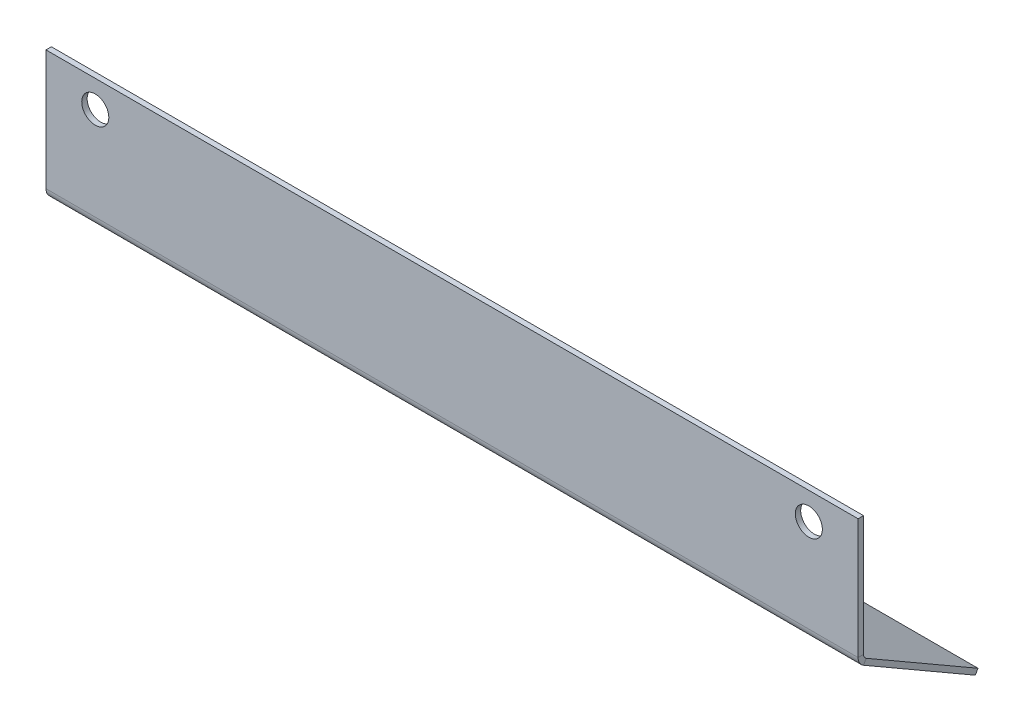
ISO-10303-21;
HEADER;
FILE_DESCRIPTION(('STEP AP214'),'2;1');
FILE_NAME('part.step','',(''),(''),'','','');
FILE_SCHEMA(('AUTOMOTIVE_DESIGN { 1 0 10303 214 1 1 1 1 }'));
ENDSEC;
DATA;
#1=APPLICATION_CONTEXT('core data for automotive mechanical design processes');
#2=APPLICATION_PROTOCOL_DEFINITION('international standard','automotive_design',2000,#1);
#3=PRODUCT_CONTEXT('',#1,'mechanical');
#4=PRODUCT('Part','Part','',(#3));
#5=PRODUCT_RELATED_PRODUCT_CATEGORY('part','',(#4));
#6=PRODUCT_DEFINITION_FORMATION('','',#4);
#7=PRODUCT_DEFINITION_CONTEXT('part definition',#1,'design');
#8=PRODUCT_DEFINITION('design','',#6,#7);
#9=PRODUCT_DEFINITION_SHAPE('','',#8);
#10=(LENGTH_UNIT() NAMED_UNIT(*) SI_UNIT(.MILLI.,.METRE.));
#11=(NAMED_UNIT(*) PLANE_ANGLE_UNIT() SI_UNIT($,.RADIAN.));
#12=(NAMED_UNIT(*) SI_UNIT($,.STERADIAN.) SOLID_ANGLE_UNIT());
#13=UNCERTAINTY_MEASURE_WITH_UNIT(LENGTH_MEASURE(1.E-05),#10,'distance_accuracy_value','');
#14=(GEOMETRIC_REPRESENTATION_CONTEXT(3) GLOBAL_UNCERTAINTY_ASSIGNED_CONTEXT((#13)) GLOBAL_UNIT_ASSIGNED_CONTEXT((#10,
#11,#12)) REPRESENTATION_CONTEXT('',''));
#15=CARTESIAN_POINT('',(0.,0.,0.));
#16=DIRECTION('',(0.,0.,1.));
#17=DIRECTION('',(1.,0.,0.));
#18=AXIS2_PLACEMENT_3D('',#15,#16,#17);
#19=CARTESIAN_POINT('',(-100.,29.2292264016467,-1.));
#20=DIRECTION('',(-1.,0.,0.));
#21=DIRECTION('',(0.,-1.,0.));
#22=AXIS2_PLACEMENT_3D('',#19,#20,#21);
#23=PLANE('',#22);
#24=DIRECTION('',(0.,-1.,0.));
#25=VECTOR('',#24,1.);
#26=CARTESIAN_POINT('',(-100.,29.2292264016467,-1.));
#27=LINE('',#26,#25);
#28=CARTESIAN_POINT('',(-100.,29.2292264016467,-1.));
#29=VERTEX_POINT('',#28);
#30=CARTESIAN_POINT('',(-100.,7.02602081011303,-1.));
#31=VERTEX_POINT('',#30);
#32=EDGE_CURVE('E125',#29,#31,#27,.T.);
#33=ORIENTED_EDGE('',*,*,#32,.T.);
#34=DIRECTION('',(0.,0.,1.));
#35=VECTOR('',#34,1.);
#36=CARTESIAN_POINT('',(-100.,7.02602081011303,-1.));
#37=LINE('',#36,#35);
#38=CARTESIAN_POINT('',(-100.,7.02602081011303,0.));
#39=VERTEX_POINT('',#38);
#40=EDGE_CURVE('E116',#31,#39,#37,.T.);
#41=ORIENTED_EDGE('',*,*,#40,.T.);
#42=DIRECTION('',(0.,-1.,0.));
#43=VECTOR('',#42,1.);
#44=CARTESIAN_POINT('',(-100.,29.2292264016467,0.));
#45=LINE('',#44,#43);
#46=CARTESIAN_POINT('',(-100.,29.2292264016467,0.));
#47=VERTEX_POINT('',#46);
#48=EDGE_CURVE('E114',#47,#39,#45,.T.);
#49=ORIENTED_EDGE('',*,*,#48,.F.);
#50=DIRECTION('',(0.,0.,1.));
#51=VECTOR('',#50,1.);
#52=CARTESIAN_POINT('',(-100.,29.2292264016467,-1.));
#53=LINE('',#52,#51);
#54=EDGE_CURVE('E15',#29,#47,#53,.T.);
#55=ORIENTED_EDGE('',*,*,#54,.F.);
#56=EDGE_LOOP('',(#33,#41,#49,#55));
#57=FACE_BOUND('',#56,.T.);
#58=ADVANCED_FACE('F72',(#57),#23,.T.);
#59=CARTESIAN_POINT('',(0.,0.,-1.));
#60=DIRECTION('',(0.,0.,1.));
#61=DIRECTION('',(1.,0.,0.));
#62=AXIS2_PLACEMENT_3D('',#59,#60,#61);
#63=PLANE('',#62);
#64=CARTESIAN_POINT('',(-90.9,24.2292264016467,-1.));
#65=DIRECTION('',(0.,0.,1.));
#66=DIRECTION('',(1.,0.,0.));
#67=AXIS2_PLACEMENT_3D('',#64,#65,#66);
#68=CIRCLE('',#67,2.49999999999999);
#69=CARTESIAN_POINT('',(-88.4,24.2292264016467,-1.));
#70=VERTEX_POINT('',#69);
#71=EDGE_CURVE('E191',#70,#70,#68,.T.);
#72=ORIENTED_EDGE('',*,*,#71,.T.);
#73=EDGE_LOOP('',(#72));
#74=FACE_BOUND('',#73,.T.);
#75=CARTESIAN_POINT('',(40.9,24.2292264016467,-1.));
#76=DIRECTION('',(0.,0.,1.));
#77=DIRECTION('',(1.,0.,0.));
#78=AXIS2_PLACEMENT_3D('',#75,#76,#77);
#79=CIRCLE('',#78,2.5);
#80=CARTESIAN_POINT('',(43.4,24.2292264016467,-1.));
#81=VERTEX_POINT('',#80);
#82=EDGE_CURVE('E155',#81,#81,#79,.T.);
#83=ORIENTED_EDGE('',*,*,#82,.T.);
#84=EDGE_LOOP('',(#83));
#85=FACE_BOUND('',#84,.T.);
#86=DIRECTION('',(-1.,0.,0.));
#87=VECTOR('',#86,1.);
#88=CARTESIAN_POINT('',(-100.,7.02602081011303,-1.));
#89=LINE('',#88,#87);
#90=CARTESIAN_POINT('',(50.,7.02602081011303,-1.));
#91=VERTEX_POINT('',#90);
#92=EDGE_CURVE('E138',#31,#91,#89,.F.);
#93=ORIENTED_EDGE('',*,*,#92,.F.);
#94=ORIENTED_EDGE('',*,*,#32,.F.);
#95=DIRECTION('',(-1.,0.,0.));
#96=VECTOR('',#95,1.);
#97=CARTESIAN_POINT('',(-100.,29.2292264016467,-1.));
#98=LINE('',#97,#96);
#99=CARTESIAN_POINT('',(50.,29.2292264016467,-1.));
#100=VERTEX_POINT('',#99);
#101=EDGE_CURVE('E111',#100,#29,#98,.T.);
#102=ORIENTED_EDGE('',*,*,#101,.F.);
#103=DIRECTION('',(0.,1.,0.));
#104=VECTOR('',#103,1.);
#105=CARTESIAN_POINT('',(50.,29.2292264016467,-1.));
#106=LINE('',#105,#104);
#107=EDGE_CURVE('E127',#91,#100,#106,.T.);
#108=ORIENTED_EDGE('',*,*,#107,.F.);
#109=EDGE_LOOP('',(#93,#94,#102,#108));
#110=FACE_BOUND('',#109,.T.);
#111=ADVANCED_FACE('F203',(#74,#85,#110),#63,.F.);
#112=CARTESIAN_POINT('',(0.,0.,0.));
#113=DIRECTION('',(0.,0.,1.));
#114=DIRECTION('',(1.,0.,0.));
#115=AXIS2_PLACEMENT_3D('',#112,#113,#114);
#116=PLANE('',#115);
#117=CARTESIAN_POINT('',(-90.9,24.2292264016467,0.));
#118=DIRECTION('',(0.,0.,1.));
#119=DIRECTION('',(-1.,0.,0.));
#120=AXIS2_PLACEMENT_3D('',#117,#118,#119);
#121=CIRCLE('',#120,2.49999999999999);
#122=CARTESIAN_POINT('',(-93.4,24.2292264016467,0.));
#123=VERTEX_POINT('',#122);
#124=EDGE_CURVE('E194',#123,#123,#121,.T.);
#125=ORIENTED_EDGE('',*,*,#124,.F.);
#126=EDGE_LOOP('',(#125));
#127=FACE_BOUND('',#126,.T.);
#128=CARTESIAN_POINT('',(40.9,24.2292264016467,0.));
#129=DIRECTION('',(0.,0.,1.));
#130=DIRECTION('',(1.,0.,0.));
#131=AXIS2_PLACEMENT_3D('',#128,#129,#130);
#132=CIRCLE('',#131,2.5);
#133=CARTESIAN_POINT('',(43.4,24.2292264016467,0.));
#134=VERTEX_POINT('',#133);
#135=EDGE_CURVE('E188',#134,#134,#132,.T.);
#136=ORIENTED_EDGE('',*,*,#135,.F.);
#137=EDGE_LOOP('',(#136));
#138=FACE_BOUND('',#137,.T.);
#139=ORIENTED_EDGE('',*,*,#48,.T.);
#140=DIRECTION('',(-1.,0.,0.));
#141=VECTOR('',#140,1.);
#142=CARTESIAN_POINT('',(-100.,7.02602081011303,0.));
#143=LINE('',#142,#141);
#144=CARTESIAN_POINT('',(50.,7.02602081011303,0.));
#145=VERTEX_POINT('',#144);
#146=EDGE_CURVE('E148',#39,#145,#143,.F.);
#147=ORIENTED_EDGE('',*,*,#146,.T.);
#148=DIRECTION('',(0.,1.,0.));
#149=VECTOR('',#148,1.);
#150=CARTESIAN_POINT('',(50.,29.2292264016467,0.));
#151=LINE('',#150,#149);
#152=CARTESIAN_POINT('',(50.,29.2292264016467,0.));
#153=VERTEX_POINT('',#152);
#154=EDGE_CURVE('E119',#145,#153,#151,.T.);
#155=ORIENTED_EDGE('',*,*,#154,.T.);
#156=DIRECTION('',(-1.,0.,0.));
#157=VECTOR('',#156,1.);
#158=CARTESIAN_POINT('',(-100.,29.2292264016467,0.));
#159=LINE('',#158,#157);
#160=EDGE_CURVE('E109',#153,#47,#159,.T.);
#161=ORIENTED_EDGE('',*,*,#160,.T.);
#162=EDGE_LOOP('',(#139,#147,#155,#161));
#163=FACE_BOUND('',#162,.T.);
#164=ADVANCED_FACE('F122',(#127,#138,#163),#116,.T.);
#165=CARTESIAN_POINT('',(-100.,29.2292264016467,-1.));
#166=DIRECTION('',(0.,1.,0.));
#167=DIRECTION('',(-1.,0.,0.));
#168=AXIS2_PLACEMENT_3D('',#165,#166,#167);
#169=PLANE('',#168);
#170=ORIENTED_EDGE('',*,*,#160,.F.);
#171=DIRECTION('',(0.,0.,1.));
#172=VECTOR('',#171,1.);
#173=CARTESIAN_POINT('',(50.,29.2292264016467,-1.));
#174=LINE('',#173,#172);
#175=EDGE_CURVE('E75',#100,#153,#174,.T.);
#176=ORIENTED_EDGE('',*,*,#175,.F.);
#177=ORIENTED_EDGE('',*,*,#101,.T.);
#178=ORIENTED_EDGE('',*,*,#54,.T.);
#179=EDGE_LOOP('',(#170,#176,#177,#178));
#180=FACE_BOUND('',#179,.T.);
#181=ADVANCED_FACE('F106',(#180),#169,.T.);
#182=CARTESIAN_POINT('',(50.,29.2292264016467,-1.));
#183=DIRECTION('',(1.,0.,0.));
#184=DIRECTION('',(0.,0.,-1.));
#185=AXIS2_PLACEMENT_3D('',#182,#183,#184);
#186=PLANE('',#185);
#187=DIRECTION('',(0.,0.,1.));
#188=VECTOR('',#187,1.);
#189=CARTESIAN_POINT('',(50.,7.02602081011303,-1.));
#190=LINE('',#189,#188);
#191=EDGE_CURVE('E120',#91,#145,#190,.T.);
#192=ORIENTED_EDGE('',*,*,#191,.F.);
#193=ORIENTED_EDGE('',*,*,#107,.T.);
#194=ORIENTED_EDGE('',*,*,#175,.T.);
#195=ORIENTED_EDGE('',*,*,#154,.F.);
#196=EDGE_LOOP('',(#192,#193,#194,#195));
#197=FACE_BOUND('',#196,.T.);
#198=ADVANCED_FACE('F237',(#197),#186,.T.);
#199=CARTESIAN_POINT('',(50.,7.02602081011303,-2.));
#200=DIRECTION('',(1.,0.,0.));
#201=DIRECTION('',(0.,0.,-1.));
#202=AXIS2_PLACEMENT_3D('',#199,#200,#201);
#203=PLANE('',#202);
#204=DIRECTION('',(0.,0.866025403784436,-0.500000000000004));
#205=VECTOR('',#204,1.);
#206=CARTESIAN_POINT('',(50.,5.29397000254415,-0.999999999999992));
#207=LINE('',#206,#205);
#208=CARTESIAN_POINT('',(50.,6.15999540632859,-1.5));
#209=VERTEX_POINT('',#208);
#210=CARTESIAN_POINT('',(50.,5.29397000254416,-0.999999999999994));
#211=VERTEX_POINT('',#210);
#212=EDGE_CURVE('E151',#209,#211,#207,.F.);
#213=ORIENTED_EDGE('',*,*,#212,.F.);
#214=CARTESIAN_POINT('',(50.,7.02602081011303,-2.));
#215=DIRECTION('',(-1.,0.,0.));
#216=DIRECTION('',(0.,0.,1.));
#217=AXIS2_PLACEMENT_3D('',#214,#215,#216);
#218=CIRCLE('',#217,1.);
#219=EDGE_CURVE('E142',#91,#209,#218,.F.);
#220=ORIENTED_EDGE('',*,*,#219,.F.);
#221=ORIENTED_EDGE('',*,*,#191,.T.);
#222=CARTESIAN_POINT('',(50.,7.02602081011303,-2.));
#223=DIRECTION('',(-1.,0.,0.));
#224=DIRECTION('',(0.,0.,1.));
#225=AXIS2_PLACEMENT_3D('',#222,#223,#224);
#226=CIRCLE('',#225,2.);
#227=EDGE_CURVE('E86',#145,#211,#226,.F.);
#228=ORIENTED_EDGE('',*,*,#227,.T.);
#229=EDGE_LOOP('',(#213,#220,#221,#228));
#230=FACE_BOUND('',#229,.T.);
#231=ADVANCED_FACE('F235',(#230),#203,.T.);
#232=CARTESIAN_POINT('',(-100.,7.02602081011303,-2.));
#233=DIRECTION('',(1.,0.,0.));
#234=DIRECTION('',(0.,0.,-1.));
#235=AXIS2_PLACEMENT_3D('',#232,#233,#234);
#236=PLANE('',#235);
#237=CARTESIAN_POINT('',(-100.,7.02602081011303,-2.));
#238=DIRECTION('',(-1.,0.,0.));
#239=DIRECTION('',(0.,0.,1.));
#240=AXIS2_PLACEMENT_3D('',#237,#238,#239);
#241=CIRCLE('',#240,1.);
#242=CARTESIAN_POINT('',(-100.,6.15999540632859,-1.5));
#243=VERTEX_POINT('',#242);
#244=EDGE_CURVE('E135',#243,#31,#241,.T.);
#245=ORIENTED_EDGE('',*,*,#244,.F.);
#246=DIRECTION('',(0.,0.866025403784436,-0.500000000000004));
#247=VECTOR('',#246,1.);
#248=CARTESIAN_POINT('',(-100.,6.15999540632859,-1.5));
#249=LINE('',#248,#247);
#250=CARTESIAN_POINT('',(-100.,5.29397000254416,-0.999999999999995));
#251=VERTEX_POINT('',#250);
#252=EDGE_CURVE('E158',#243,#251,#249,.F.);
#253=ORIENTED_EDGE('',*,*,#252,.T.);
#254=CARTESIAN_POINT('',(-100.,7.02602081011303,-2.));
#255=DIRECTION('',(-1.,0.,0.));
#256=DIRECTION('',(0.,0.,1.));
#257=AXIS2_PLACEMENT_3D('',#254,#255,#256);
#258=CIRCLE('',#257,2.);
#259=EDGE_CURVE('E145',#251,#39,#258,.T.);
#260=ORIENTED_EDGE('',*,*,#259,.T.);
#261=ORIENTED_EDGE('',*,*,#40,.F.);
#262=EDGE_LOOP('',(#245,#253,#260,#261));
#263=FACE_BOUND('',#262,.T.);
#264=ADVANCED_FACE('F243',(#263),#236,.F.);
#265=CARTESIAN_POINT('',(-100.,7.02602081011303,-2.));
#266=DIRECTION('',(-1.,0.,0.));
#267=DIRECTION('',(0.,-0.866025403784436,0.500000000000004));
#268=AXIS2_PLACEMENT_3D('',#265,#266,#267);
#269=CYLINDRICAL_SURFACE('',#268,2.);
#270=ORIENTED_EDGE('',*,*,#146,.F.);
#271=ORIENTED_EDGE('',*,*,#259,.F.);
#272=DIRECTION('',(-1.,0.,0.));
#273=VECTOR('',#272,1.);
#274=CARTESIAN_POINT('',(50.,5.29397000254416,-0.999999999999993));
#275=LINE('',#274,#273);
#276=EDGE_CURVE('E161',#251,#211,#275,.F.);
#277=ORIENTED_EDGE('',*,*,#276,.T.);
#278=ORIENTED_EDGE('',*,*,#227,.F.);
#279=EDGE_LOOP('',(#270,#271,#277,#278));
#280=FACE_BOUND('',#279,.T.);
#281=ADVANCED_FACE('F301',(#280),#269,.T.);
#282=CARTESIAN_POINT('',(-100.,7.02602081011303,-2.));
#283=DIRECTION('',(-1.,0.,0.));
#284=DIRECTION('',(0.,-0.866025403784436,0.500000000000004));
#285=AXIS2_PLACEMENT_3D('',#282,#283,#284);
#286=CYLINDRICAL_SURFACE('',#285,1.);
#287=ORIENTED_EDGE('',*,*,#92,.T.);
#288=ORIENTED_EDGE('',*,*,#219,.T.);
#289=DIRECTION('',(-1.,0.,0.));
#290=VECTOR('',#289,1.);
#291=CARTESIAN_POINT('',(50.,6.15999540632859,-1.5));
#292=LINE('',#291,#290);
#293=EDGE_CURVE('E154',#209,#243,#292,.T.);
#294=ORIENTED_EDGE('',*,*,#293,.T.);
#295=ORIENTED_EDGE('',*,*,#244,.T.);
#296=EDGE_LOOP('',(#287,#288,#294,#295));
#297=FACE_BOUND('',#296,.T.);
#298=ADVANCED_FACE('F226',(#297),#286,.F.);
#299=CARTESIAN_POINT('',(-100.,-6.62867972826632,-21.6506350946109));
#300=DIRECTION('',(1.,0.,0.));
#301=DIRECTION('',(0.,0.,-1.));
#302=AXIS2_PLACEMENT_3D('',#299,#300,#301);
#303=PLANE('',#302);
#304=ORIENTED_EDGE('',*,*,#252,.F.);
#305=DIRECTION('',(0.,0.500000000000004,0.866025403784436));
#306=VECTOR('',#305,1.);
#307=CARTESIAN_POINT('',(-100.,-5.76265432448188,-22.1506350946109));
#308=LINE('',#307,#306);
#309=CARTESIAN_POINT('',(-100.,-5.76265432448188,-22.1506350946109));
#310=VERTEX_POINT('',#309);
#311=EDGE_CURVE('E163',#243,#310,#308,.F.);
#312=ORIENTED_EDGE('',*,*,#311,.T.);
#313=DIRECTION('',(0.,0.866025403784436,-0.500000000000004));
#314=VECTOR('',#313,1.);
#315=CARTESIAN_POINT('',(-100.,-6.62867972826632,-21.6506350946109));
#316=LINE('',#315,#314);
#317=CARTESIAN_POINT('',(-100.,-6.62867972826632,-21.6506350946109));
#318=VERTEX_POINT('',#317);
#319=EDGE_CURVE('E139',#318,#310,#316,.T.);
#320=ORIENTED_EDGE('',*,*,#319,.F.);
#321=DIRECTION('',(0.,-0.500000000000004,-0.866025403784436));
#322=VECTOR('',#321,1.);
#323=CARTESIAN_POINT('',(-100.,4.54782777109775,-2.29235625453797));
#324=LINE('',#323,#322);
#325=EDGE_CURVE('E172',#251,#318,#324,.T.);
#326=ORIENTED_EDGE('',*,*,#325,.F.);
#327=EDGE_LOOP('',(#304,#312,#320,#326));
#328=FACE_BOUND('',#327,.T.);
#329=ADVANCED_FACE('F321',(#328),#303,.F.);
#330=CARTESIAN_POINT('',(50.,5.58264513713897,-0.499999999999995));
#331=DIRECTION('',(-1.,0.,0.));
#332=DIRECTION('',(0.,0.,1.));
#333=AXIS2_PLACEMENT_3D('',#330,#331,#332);
#334=PLANE('',#333);
#335=ORIENTED_EDGE('',*,*,#212,.T.);
#336=DIRECTION('',(0.,0.500000000000004,0.866025403784436));
#337=VECTOR('',#336,1.);
#338=CARTESIAN_POINT('',(50.,4.54782777109772,-2.29235625453802));
#339=LINE('',#338,#337);
#340=CARTESIAN_POINT('',(50.,-6.62867972826632,-21.6506350946109));
#341=VERTEX_POINT('',#340);
#342=EDGE_CURVE('E178',#341,#211,#339,.T.);
#343=ORIENTED_EDGE('',*,*,#342,.F.);
#344=DIRECTION('',(0.,0.866025403784436,-0.500000000000004));
#345=VECTOR('',#344,1.);
#346=CARTESIAN_POINT('',(50.,-6.62867972826632,-21.6506350946109));
#347=LINE('',#346,#345);
#348=CARTESIAN_POINT('',(50.,-5.76265432448188,-22.1506350946109));
#349=VERTEX_POINT('',#348);
#350=EDGE_CURVE('E181',#341,#349,#347,.T.);
#351=ORIENTED_EDGE('',*,*,#350,.T.);
#352=DIRECTION('',(0.,-0.500000000000004,-0.866025403784436));
#353=VECTOR('',#352,1.);
#354=CARTESIAN_POINT('',(50.,6.44867054092341,-1.));
#355=LINE('',#354,#353);
#356=EDGE_CURVE('E169',#349,#209,#355,.F.);
#357=ORIENTED_EDGE('',*,*,#356,.T.);
#358=EDGE_LOOP('',(#335,#343,#351,#357));
#359=FACE_BOUND('',#358,.T.);
#360=ADVANCED_FACE('F331',(#359),#334,.F.);
#361=CARTESIAN_POINT('',(0.,4.54782777109772,-2.29235625453802));
#362=DIRECTION('',(0.,0.866025403784436,-0.500000000000004));
#363=DIRECTION('',(0.,0.500000000000004,0.866025403784436));
#364=AXIS2_PLACEMENT_3D('',#361,#362,#363);
#365=PLANE('',#364);
#366=ORIENTED_EDGE('',*,*,#276,.F.);
#367=ORIENTED_EDGE('',*,*,#325,.T.);
#368=DIRECTION('',(1.,0.,0.));
#369=VECTOR('',#368,1.);
#370=CARTESIAN_POINT('',(0.,-6.62867972826632,-21.6506350946109));
#371=LINE('',#370,#369);
#372=EDGE_CURVE('E175',#318,#341,#371,.T.);
#373=ORIENTED_EDGE('',*,*,#372,.T.);
#374=ORIENTED_EDGE('',*,*,#342,.T.);
#375=EDGE_LOOP('',(#366,#367,#373,#374));
#376=FACE_BOUND('',#375,.T.);
#377=ADVANCED_FACE('F342',(#376),#365,.F.);
#378=CARTESIAN_POINT('',(0.,5.41385317488216,-2.79235625453802));
#379=DIRECTION('',(0.,0.866025403784436,-0.500000000000004));
#380=DIRECTION('',(0.,0.500000000000004,0.866025403784436));
#381=AXIS2_PLACEMENT_3D('',#378,#379,#380);
#382=PLANE('',#381);
#383=ORIENTED_EDGE('',*,*,#311,.F.);
#384=ORIENTED_EDGE('',*,*,#293,.F.);
#385=ORIENTED_EDGE('',*,*,#356,.F.);
#386=DIRECTION('',(-1.,0.,0.));
#387=VECTOR('',#386,1.);
#388=CARTESIAN_POINT('',(50.,-5.76265432448188,-22.1506350946109));
#389=LINE('',#388,#387);
#390=EDGE_CURVE('E166',#310,#349,#389,.F.);
#391=ORIENTED_EDGE('',*,*,#390,.F.);
#392=EDGE_LOOP('',(#383,#384,#385,#391));
#393=FACE_BOUND('',#392,.T.);
#394=ADVANCED_FACE('F353',(#393),#382,.T.);
#395=CARTESIAN_POINT('',(50.,-6.62867972826632,-21.6506350946109));
#396=DIRECTION('',(0.,0.500000000000004,0.866025403784436));
#397=DIRECTION('',(0.,-0.866025403784436,0.500000000000004));
#398=AXIS2_PLACEMENT_3D('',#395,#396,#397);
#399=PLANE('',#398);
#400=ORIENTED_EDGE('',*,*,#390,.T.);
#401=ORIENTED_EDGE('',*,*,#350,.F.);
#402=ORIENTED_EDGE('',*,*,#372,.F.);
#403=ORIENTED_EDGE('',*,*,#319,.T.);
#404=EDGE_LOOP('',(#400,#401,#402,#403));
#405=FACE_BOUND('',#404,.T.);
#406=ADVANCED_FACE('F210',(#405),#399,.F.);
#407=CARTESIAN_POINT('',(40.9,24.2292264016467,-3.));
#408=DIRECTION('',(0.,0.,1.));
#409=DIRECTION('',(1.,0.,0.));
#410=AXIS2_PLACEMENT_3D('',#407,#408,#409);
#411=CYLINDRICAL_SURFACE('',#410,2.5);
#412=ORIENTED_EDGE('',*,*,#135,.T.);
#413=EDGE_LOOP('',(#412));
#414=FACE_BOUND('',#413,.T.);
#415=ORIENTED_EDGE('',*,*,#82,.F.);
#416=EDGE_LOOP('',(#415));
#417=FACE_BOUND('',#416,.T.);
#418=ADVANCED_FACE('F207',(#414,#417),#411,.F.);
#419=CARTESIAN_POINT('',(-90.9,24.2292264016467,-3.));
#420=DIRECTION('',(0.,0.,1.));
#421=DIRECTION('',(1.,0.,0.));
#422=AXIS2_PLACEMENT_3D('',#419,#420,#421);
#423=CYLINDRICAL_SURFACE('',#422,2.49999999999999);
#424=ORIENTED_EDGE('',*,*,#124,.T.);
#425=EDGE_LOOP('',(#424));
#426=FACE_BOUND('',#425,.T.);
#427=ORIENTED_EDGE('',*,*,#71,.F.);
#428=EDGE_LOOP('',(#427));
#429=FACE_BOUND('',#428,.T.);
#430=ADVANCED_FACE('F198',(#426,#429),#423,.F.);
#431=CLOSED_SHELL('',(#58,#111,#164,#181,#198,#231,#264,#281,#298,#329,#360,#377,#394,#406,#418,#430));
#432=MANIFOLD_SOLID_BREP('B2',#431);
#433=ADVANCED_BREP_SHAPE_REPRESENTATION('',(#18,#432),#14);
#434=SHAPE_DEFINITION_REPRESENTATION(#9,#433);
ENDSEC;
END-ISO-10303-21;
